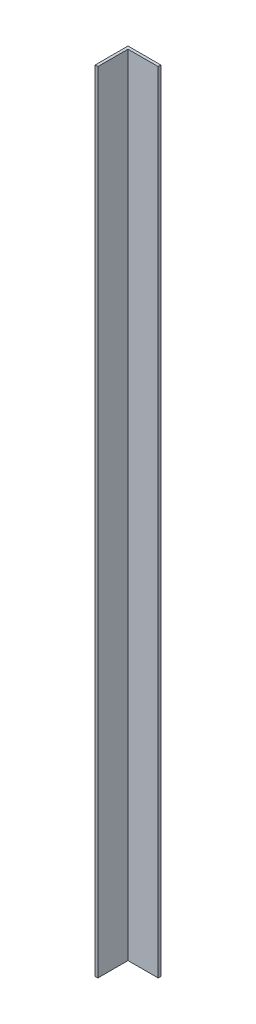
ISO-10303-21;
HEADER;
FILE_DESCRIPTION(('STEP AP214'),'2;1');
FILE_NAME('part.step','',(''),(''),'','','');
FILE_SCHEMA(('AUTOMOTIVE_DESIGN { 1 0 10303 214 1 1 1 1 }'));
ENDSEC;
DATA;
#1=APPLICATION_CONTEXT('core data for automotive mechanical design processes');
#2=APPLICATION_PROTOCOL_DEFINITION('international standard','automotive_design',2000,#1);
#3=PRODUCT_CONTEXT('',#1,'mechanical');
#4=PRODUCT('Part','Part','',(#3));
#5=PRODUCT_RELATED_PRODUCT_CATEGORY('part','',(#4));
#6=PRODUCT_DEFINITION_FORMATION('','',#4);
#7=PRODUCT_DEFINITION_CONTEXT('part definition',#1,'design');
#8=PRODUCT_DEFINITION('design','',#6,#7);
#9=PRODUCT_DEFINITION_SHAPE('','',#8);
#10=(LENGTH_UNIT() NAMED_UNIT(*) SI_UNIT(.MILLI.,.METRE.));
#11=(NAMED_UNIT(*) PLANE_ANGLE_UNIT() SI_UNIT($,.RADIAN.));
#12=(NAMED_UNIT(*) SI_UNIT($,.STERADIAN.) SOLID_ANGLE_UNIT());
#13=UNCERTAINTY_MEASURE_WITH_UNIT(LENGTH_MEASURE(1.E-05),#10,'distance_accuracy_value','');
#14=(GEOMETRIC_REPRESENTATION_CONTEXT(3) GLOBAL_UNCERTAINTY_ASSIGNED_CONTEXT((#13)) GLOBAL_UNIT_ASSIGNED_CONTEXT((#10,
#11,#12)) REPRESENTATION_CONTEXT('',''));
#15=CARTESIAN_POINT('',(0.,0.,0.));
#16=DIRECTION('',(0.,0.,1.));
#17=DIRECTION('',(1.,0.,0.));
#18=AXIS2_PLACEMENT_3D('',#15,#16,#17);
#19=CARTESIAN_POINT('',(0.,457.2,-17.4625));
#20=DIRECTION('',(0.,0.,-1.));
#21=DIRECTION('',(-1.,0.,0.));
#22=AXIS2_PLACEMENT_3D('',#19,#20,#21);
#23=PLANE('',#22);
#24=DIRECTION('',(1.,0.,0.));
#25=VECTOR('',#24,1.);
#26=CARTESIAN_POINT('',(0.,0.,-17.4625));
#27=LINE('',#26,#25);
#28=CARTESIAN_POINT('',(1.5875,0.,-17.4625));
#29=VERTEX_POINT('',#28);
#30=CARTESIAN_POINT('',(19.05,0.,-17.4625));
#31=VERTEX_POINT('',#30);
#32=EDGE_CURVE('E114',#29,#31,#27,.T.);
#33=ORIENTED_EDGE('',*,*,#32,.T.);
#34=DIRECTION('',(0.,-1.,0.));
#35=VECTOR('',#34,1.);
#36=CARTESIAN_POINT('',(19.05,457.2,-17.4625));
#37=LINE('',#36,#35);
#38=CARTESIAN_POINT('',(19.05,457.2,-17.4625));
#39=VERTEX_POINT('',#38);
#40=EDGE_CURVE('E11',#39,#31,#37,.T.);
#41=ORIENTED_EDGE('',*,*,#40,.F.);
#42=DIRECTION('',(1.,0.,0.));
#43=VECTOR('',#42,1.);
#44=CARTESIAN_POINT('',(0.,457.2,-17.4625));
#45=LINE('',#44,#43);
#46=CARTESIAN_POINT('',(1.5875,457.2,-17.4625));
#47=VERTEX_POINT('',#46);
#48=EDGE_CURVE('E79',#47,#39,#45,.T.);
#49=ORIENTED_EDGE('',*,*,#48,.F.);
#50=DIRECTION('',(0.,-1.,0.));
#51=VECTOR('',#50,1.);
#52=CARTESIAN_POINT('',(1.5875,457.2,-17.4625));
#53=LINE('',#52,#51);
#54=EDGE_CURVE('E110',#47,#29,#53,.T.);
#55=ORIENTED_EDGE('',*,*,#54,.T.);
#56=EDGE_LOOP('',(#33,#41,#49,#55));
#57=FACE_BOUND('',#56,.T.);
#58=ADVANCED_FACE('F33',(#57),#23,.F.);
#59=CARTESIAN_POINT('',(19.05,457.2,-19.05));
#60=DIRECTION('',(1.,0.,0.));
#61=DIRECTION('',(0.,0.,-1.));
#62=AXIS2_PLACEMENT_3D('',#59,#60,#61);
#63=PLANE('',#62);
#64=DIRECTION('',(0.,0.,1.));
#65=VECTOR('',#64,1.);
#66=CARTESIAN_POINT('',(19.05,0.,-19.05));
#67=LINE('',#66,#65);
#68=CARTESIAN_POINT('',(19.05,0.,-19.05));
#69=VERTEX_POINT('',#68);
#70=EDGE_CURVE('E117',#69,#31,#67,.T.);
#71=ORIENTED_EDGE('',*,*,#70,.F.);
#72=DIRECTION('',(0.,-1.,0.));
#73=VECTOR('',#72,1.);
#74=CARTESIAN_POINT('',(19.05,457.2,-19.05));
#75=LINE('',#74,#73);
#76=CARTESIAN_POINT('',(19.05,457.2,-19.05));
#77=VERTEX_POINT('',#76);
#78=EDGE_CURVE('E41',#77,#69,#75,.T.);
#79=ORIENTED_EDGE('',*,*,#78,.F.);
#80=DIRECTION('',(0.,0.,1.));
#81=VECTOR('',#80,1.);
#82=CARTESIAN_POINT('',(19.05,457.2,-19.05));
#83=LINE('',#82,#81);
#84=EDGE_CURVE('E203',#77,#39,#83,.T.);
#85=ORIENTED_EDGE('',*,*,#84,.T.);
#86=ORIENTED_EDGE('',*,*,#40,.T.);
#87=EDGE_LOOP('',(#71,#79,#85,#86));
#88=FACE_BOUND('',#87,.T.);
#89=ADVANCED_FACE('F135',(#88),#63,.T.);
#90=CARTESIAN_POINT('',(0.,457.2,-19.05));
#91=DIRECTION('',(0.,0.,-1.));
#92=DIRECTION('',(-1.,0.,0.));
#93=AXIS2_PLACEMENT_3D('',#90,#91,#92);
#94=PLANE('',#93);
#95=DIRECTION('',(1.,0.,0.));
#96=VECTOR('',#95,1.);
#97=CARTESIAN_POINT('',(0.,0.,-19.05));
#98=LINE('',#97,#96);
#99=CARTESIAN_POINT('',(0.,0.,-19.05));
#100=VERTEX_POINT('',#99);
#101=EDGE_CURVE('E120',#100,#69,#98,.T.);
#102=ORIENTED_EDGE('',*,*,#101,.F.);
#103=DIRECTION('',(0.,-1.,0.));
#104=VECTOR('',#103,1.);
#105=CARTESIAN_POINT('',(0.,457.2,-19.05));
#106=LINE('',#105,#104);
#107=CARTESIAN_POINT('',(0.,457.2,-19.05));
#108=VERTEX_POINT('',#107);
#109=EDGE_CURVE('E100',#108,#100,#106,.T.);
#110=ORIENTED_EDGE('',*,*,#109,.F.);
#111=DIRECTION('',(1.,0.,0.));
#112=VECTOR('',#111,1.);
#113=CARTESIAN_POINT('',(0.,457.2,-19.05));
#114=LINE('',#113,#112);
#115=EDGE_CURVE('E106',#108,#77,#114,.T.);
#116=ORIENTED_EDGE('',*,*,#115,.T.);
#117=ORIENTED_EDGE('',*,*,#78,.T.);
#118=EDGE_LOOP('',(#102,#110,#116,#117));
#119=FACE_BOUND('',#118,.T.);
#120=ADVANCED_FACE('F132',(#119),#94,.T.);
#121=CARTESIAN_POINT('',(0.,457.2,0.));
#122=DIRECTION('',(-1.,0.,0.));
#123=DIRECTION('',(0.,0.,1.));
#124=AXIS2_PLACEMENT_3D('',#121,#122,#123);
#125=PLANE('',#124);
#126=DIRECTION('',(0.,0.,-1.));
#127=VECTOR('',#126,1.);
#128=CARTESIAN_POINT('',(0.,0.,0.));
#129=LINE('',#128,#127);
#130=CARTESIAN_POINT('',(0.,0.,0.));
#131=VERTEX_POINT('',#130);
#132=EDGE_CURVE('E95',#131,#100,#129,.T.);
#133=ORIENTED_EDGE('',*,*,#132,.F.);
#134=DIRECTION('',(0.,-1.,0.));
#135=VECTOR('',#134,1.);
#136=CARTESIAN_POINT('',(0.,457.2,0.));
#137=LINE('',#136,#135);
#138=CARTESIAN_POINT('',(0.,457.2,0.));
#139=VERTEX_POINT('',#138);
#140=EDGE_CURVE('E90',#139,#131,#137,.T.);
#141=ORIENTED_EDGE('',*,*,#140,.F.);
#142=DIRECTION('',(0.,0.,-1.));
#143=VECTOR('',#142,1.);
#144=CARTESIAN_POINT('',(0.,457.2,0.));
#145=LINE('',#144,#143);
#146=EDGE_CURVE('E93',#139,#108,#145,.T.);
#147=ORIENTED_EDGE('',*,*,#146,.T.);
#148=ORIENTED_EDGE('',*,*,#109,.T.);
#149=EDGE_LOOP('',(#133,#141,#147,#148));
#150=FACE_BOUND('',#149,.T.);
#151=ADVANCED_FACE('F92',(#150),#125,.T.);
#152=CARTESIAN_POINT('',(1.5875,457.2,0.));
#153=DIRECTION('',(0.,0.,1.));
#154=DIRECTION('',(1.,0.,0.));
#155=AXIS2_PLACEMENT_3D('',#152,#153,#154);
#156=PLANE('',#155);
#157=DIRECTION('',(-1.,0.,0.));
#158=VECTOR('',#157,1.);
#159=CARTESIAN_POINT('',(1.5875,0.,0.));
#160=LINE('',#159,#158);
#161=CARTESIAN_POINT('',(1.5875,0.,0.));
#162=VERTEX_POINT('',#161);
#163=EDGE_CURVE('E124',#162,#131,#160,.T.);
#164=ORIENTED_EDGE('',*,*,#163,.F.);
#165=DIRECTION('',(0.,-1.,0.));
#166=VECTOR('',#165,1.);
#167=CARTESIAN_POINT('',(1.5875,457.2,0.));
#168=LINE('',#167,#166);
#169=CARTESIAN_POINT('',(1.5875,457.2,0.));
#170=VERTEX_POINT('',#169);
#171=EDGE_CURVE('E70',#170,#162,#168,.T.);
#172=ORIENTED_EDGE('',*,*,#171,.F.);
#173=DIRECTION('',(-1.,0.,0.));
#174=VECTOR('',#173,1.);
#175=CARTESIAN_POINT('',(1.5875,457.2,0.));
#176=LINE('',#175,#174);
#177=EDGE_CURVE('E104',#170,#139,#176,.T.);
#178=ORIENTED_EDGE('',*,*,#177,.T.);
#179=ORIENTED_EDGE('',*,*,#140,.T.);
#180=EDGE_LOOP('',(#164,#172,#178,#179));
#181=FACE_BOUND('',#180,.T.);
#182=ADVANCED_FACE('F108',(#181),#156,.T.);
#183=CARTESIAN_POINT('',(1.5875,457.2,0.));
#184=DIRECTION('',(-1.,0.,0.));
#185=DIRECTION('',(0.,0.,1.));
#186=AXIS2_PLACEMENT_3D('',#183,#184,#185);
#187=PLANE('',#186);
#188=DIRECTION('',(0.,0.,-1.));
#189=VECTOR('',#188,1.);
#190=CARTESIAN_POINT('',(1.5875,0.,0.));
#191=LINE('',#190,#189);
#192=EDGE_CURVE('E73',#162,#29,#191,.T.);
#193=ORIENTED_EDGE('',*,*,#192,.T.);
#194=ORIENTED_EDGE('',*,*,#54,.F.);
#195=DIRECTION('',(0.,0.,-1.));
#196=VECTOR('',#195,1.);
#197=CARTESIAN_POINT('',(1.5875,457.2,0.));
#198=LINE('',#197,#196);
#199=EDGE_CURVE('E49',#170,#47,#198,.T.);
#200=ORIENTED_EDGE('',*,*,#199,.F.);
#201=ORIENTED_EDGE('',*,*,#171,.T.);
#202=EDGE_LOOP('',(#193,#194,#200,#201));
#203=FACE_BOUND('',#202,.T.);
#204=ADVANCED_FACE('F140',(#203),#187,.F.);
#205=CARTESIAN_POINT('',(0.,457.2,0.));
#206=DIRECTION('',(0.,-1.,0.));
#207=DIRECTION('',(-1.,0.,0.));
#208=AXIS2_PLACEMENT_3D('',#205,#206,#207);
#209=PLANE('',#208);
#210=ORIENTED_EDGE('',*,*,#48,.T.);
#211=ORIENTED_EDGE('',*,*,#84,.F.);
#212=ORIENTED_EDGE('',*,*,#115,.F.);
#213=ORIENTED_EDGE('',*,*,#146,.F.);
#214=ORIENTED_EDGE('',*,*,#177,.F.);
#215=ORIENTED_EDGE('',*,*,#199,.T.);
#216=EDGE_LOOP('',(#210,#211,#212,#213,#214,#215));
#217=FACE_BOUND('',#216,.T.);
#218=ADVANCED_FACE('F103',(#217),#209,.F.);
#219=CARTESIAN_POINT('',(0.,0.,0.));
#220=DIRECTION('',(0.,-1.,0.));
#221=DIRECTION('',(-1.,0.,0.));
#222=AXIS2_PLACEMENT_3D('',#219,#220,#221);
#223=PLANE('',#222);
#224=ORIENTED_EDGE('',*,*,#32,.F.);
#225=ORIENTED_EDGE('',*,*,#192,.F.);
#226=ORIENTED_EDGE('',*,*,#163,.T.);
#227=ORIENTED_EDGE('',*,*,#132,.T.);
#228=ORIENTED_EDGE('',*,*,#101,.T.);
#229=ORIENTED_EDGE('',*,*,#70,.T.);
#230=EDGE_LOOP('',(#224,#225,#226,#227,#228,#229));
#231=FACE_BOUND('',#230,.T.);
#232=ADVANCED_FACE('F138',(#231),#223,.T.);
#233=CLOSED_SHELL('',(#58,#89,#120,#151,#182,#204,#218,#232));
#234=MANIFOLD_SOLID_BREP('B2',#233);
#235=ADVANCED_BREP_SHAPE_REPRESENTATION('',(#18,#234),#14);
#236=SHAPE_DEFINITION_REPRESENTATION(#9,#235);
ENDSEC;
END-ISO-10303-21;
